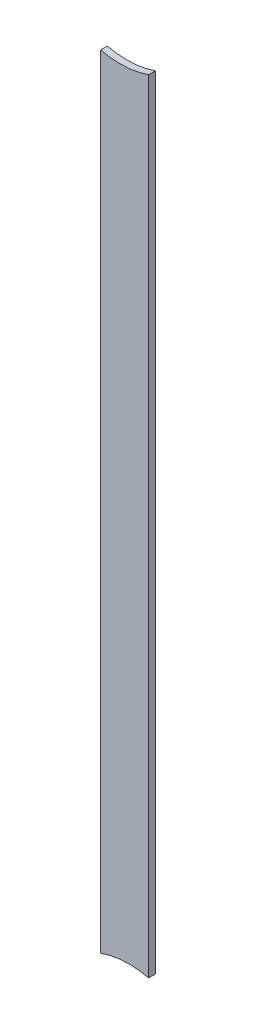
ISO-10303-21;
HEADER;
FILE_DESCRIPTION(('STEP AP214'),'2;1');
FILE_NAME('part.step','',(''),(''),'','','');
FILE_SCHEMA(('AUTOMOTIVE_DESIGN { 1 0 10303 214 1 1 1 1 }'));
ENDSEC;
DATA;
#1=APPLICATION_CONTEXT('core data for automotive mechanical design processes');
#2=APPLICATION_PROTOCOL_DEFINITION('international standard','automotive_design',2000,#1);
#3=PRODUCT_CONTEXT('',#1,'mechanical');
#4=PRODUCT('Part','Part','',(#3));
#5=PRODUCT_RELATED_PRODUCT_CATEGORY('part','',(#4));
#6=PRODUCT_DEFINITION_FORMATION('','',#4);
#7=PRODUCT_DEFINITION_CONTEXT('part definition',#1,'design');
#8=PRODUCT_DEFINITION('design','',#6,#7);
#9=PRODUCT_DEFINITION_SHAPE('','',#8);
#10=(LENGTH_UNIT() NAMED_UNIT(*) SI_UNIT(.MILLI.,.METRE.));
#11=(NAMED_UNIT(*) PLANE_ANGLE_UNIT() SI_UNIT($,.RADIAN.));
#12=(NAMED_UNIT(*) SI_UNIT($,.STERADIAN.) SOLID_ANGLE_UNIT());
#13=UNCERTAINTY_MEASURE_WITH_UNIT(LENGTH_MEASURE(1.E-05),#10,'distance_accuracy_value','');
#14=(GEOMETRIC_REPRESENTATION_CONTEXT(3) GLOBAL_UNCERTAINTY_ASSIGNED_CONTEXT((#13)) GLOBAL_UNIT_ASSIGNED_CONTEXT((#10,
#11,#12)) REPRESENTATION_CONTEXT('',''));
#15=CARTESIAN_POINT('',(0.,0.,0.));
#16=DIRECTION('',(0.,0.,1.));
#17=DIRECTION('',(1.,0.,0.));
#18=AXIS2_PLACEMENT_3D('',#15,#16,#17);
#19=CARTESIAN_POINT('',(89.0409954,88.0247857001998,0.));
#20=DIRECTION('',(-1.,0.,0.));
#21=DIRECTION('',(0.,1.,0.));
#22=AXIS2_PLACEMENT_3D('',#19,#20,#21);
#23=PLANE('',#22);
#24=DIRECTION('',(0.,1.,0.));
#25=VECTOR('',#24,1.);
#26=CARTESIAN_POINT('',(89.0409954,87.6099594,0.03556));
#27=LINE('',#26,#25);
#28=CARTESIAN_POINT('',(89.0409954,88.0247857001998,0.03556));
#29=VERTEX_POINT('',#28);
#30=CARTESIAN_POINT('',(89.0409954,92.149740689902,0.03556));
#31=VERTEX_POINT('',#30);
#32=EDGE_CURVE('E11',#29,#31,#27,.T.);
#33=ORIENTED_EDGE('',*,*,#32,.F.);
#34=DIRECTION('',(0.,0.,1.));
#35=VECTOR('',#34,1.);
#36=CARTESIAN_POINT('',(89.0409954,88.0247857001998,0.));
#37=LINE('',#36,#35);
#38=CARTESIAN_POINT('',(89.0409954,88.0247857001998,0.));
#39=VERTEX_POINT('',#38);
#40=EDGE_CURVE('E24',#39,#29,#37,.T.);
#41=ORIENTED_EDGE('',*,*,#40,.F.);
#42=DIRECTION('',(0.,1.,0.));
#43=VECTOR('',#42,1.);
#44=CARTESIAN_POINT('',(89.0409954,87.6099594,0.));
#45=LINE('',#44,#43);
#46=CARTESIAN_POINT('',(89.0409954,92.149740689902,0.));
#47=VERTEX_POINT('',#46);
#48=EDGE_CURVE('E75',#39,#47,#45,.T.);
#49=ORIENTED_EDGE('',*,*,#48,.T.);
#50=DIRECTION('',(0.,0.,1.));
#51=VECTOR('',#50,1.);
#52=CARTESIAN_POINT('',(89.0409954,92.149740689902,0.));
#53=LINE('',#52,#51);
#54=EDGE_CURVE('E37',#47,#31,#53,.T.);
#55=ORIENTED_EDGE('',*,*,#54,.T.);
#56=EDGE_LOOP('',(#33,#41,#49,#55));
#57=FACE_BOUND('',#56,.T.);
#58=ADVANCED_FACE('F17',(#57),#23,.F.);
#59=CARTESIAN_POINT('',(88.8910084,92.5740084,0.));
#60=DIRECTION('',(0.,0.,-1.));
#61=DIRECTION('',(1.,0.,0.));
#62=AXIS2_PLACEMENT_3D('',#59,#60,#61);
#63=CYLINDRICAL_SURFACE('',#62,0.4499991);
#64=DIRECTION('',(0.,0.,1.));
#65=VECTOR('',#64,1.);
#66=CARTESIAN_POINT('',(88.7869954,92.1361950998002,0.));
#67=LINE('',#66,#65);
#68=CARTESIAN_POINT('',(88.7869954,92.1361950998002,0.));
#69=VERTEX_POINT('',#68);
#70=CARTESIAN_POINT('',(88.7869954,92.1361950998002,0.03556));
#71=VERTEX_POINT('',#70);
#72=EDGE_CURVE('E67',#69,#71,#67,.T.);
#73=ORIENTED_EDGE('',*,*,#72,.T.);
#74=CARTESIAN_POINT('',(88.8910084,92.5740084,0.03556));
#75=DIRECTION('',(0.,0.,1.));
#76=DIRECTION('',(1.,0.,0.));
#77=AXIS2_PLACEMENT_3D('',#74,#75,#76);
#78=CIRCLE('',#77,0.4499991);
#79=EDGE_CURVE('E82',#71,#31,#78,.T.);
#80=ORIENTED_EDGE('',*,*,#79,.T.);
#81=ORIENTED_EDGE('',*,*,#54,.F.);
#82=CARTESIAN_POINT('',(88.8910084,92.5740084,0.));
#83=DIRECTION('',(0.,0.,1.));
#84=DIRECTION('',(1.,0.,0.));
#85=AXIS2_PLACEMENT_3D('',#82,#83,#84);
#86=CIRCLE('',#85,0.4499991);
#87=EDGE_CURVE('E80',#69,#47,#86,.T.);
#88=ORIENTED_EDGE('',*,*,#87,.F.);
#89=EDGE_LOOP('',(#73,#80,#81,#88));
#90=FACE_BOUND('',#89,.T.);
#91=ADVANCED_FACE('F88',(#90),#63,.F.);
#92=CARTESIAN_POINT('',(88.7869954,92.1361950998002,0.));
#93=DIRECTION('',(1.,0.,0.));
#94=DIRECTION('',(0.,-1.,0.));
#95=AXIS2_PLACEMENT_3D('',#92,#93,#94);
#96=PLANE('',#95);
#97=DIRECTION('',(0.,-1.,0.));
#98=VECTOR('',#97,1.);
#99=CARTESIAN_POINT('',(88.7869954,92.5510214,0.03556));
#100=LINE('',#99,#98);
#101=CARTESIAN_POINT('',(88.7869954,88.011240110098,0.03556));
#102=VERTEX_POINT('',#101);
#103=EDGE_CURVE('E71',#71,#102,#100,.T.);
#104=ORIENTED_EDGE('',*,*,#103,.F.);
#105=ORIENTED_EDGE('',*,*,#72,.F.);
#106=DIRECTION('',(0.,-1.,0.));
#107=VECTOR('',#106,1.);
#108=CARTESIAN_POINT('',(88.7869954,92.5510214,0.));
#109=LINE('',#108,#107);
#110=CARTESIAN_POINT('',(88.7869954,88.011240110098,0.));
#111=VERTEX_POINT('',#110);
#112=EDGE_CURVE('E63',#69,#111,#109,.T.);
#113=ORIENTED_EDGE('',*,*,#112,.T.);
#114=DIRECTION('',(0.,0.,1.));
#115=VECTOR('',#114,1.);
#116=CARTESIAN_POINT('',(88.7869954,88.011240110098,0.));
#117=LINE('',#116,#115);
#118=EDGE_CURVE('E53',#111,#102,#117,.T.);
#119=ORIENTED_EDGE('',*,*,#118,.T.);
#120=EDGE_LOOP('',(#104,#105,#113,#119));
#121=FACE_BOUND('',#120,.T.);
#122=ADVANCED_FACE('F66',(#121),#96,.F.);
#123=CARTESIAN_POINT('',(88.9369824,87.5869724,0.));
#124=DIRECTION('',(0.,0.,-1.));
#125=DIRECTION('',(1.,0.,0.));
#126=AXIS2_PLACEMENT_3D('',#123,#124,#125);
#127=CYLINDRICAL_SURFACE('',#126,0.4499991);
#128=ORIENTED_EDGE('',*,*,#40,.T.);
#129=CARTESIAN_POINT('',(88.9369824,87.5869724,0.03556));
#130=DIRECTION('',(0.,0.,1.));
#131=DIRECTION('',(1.,0.,0.));
#132=AXIS2_PLACEMENT_3D('',#129,#130,#131);
#133=CIRCLE('',#132,0.4499991);
#134=EDGE_CURVE('E59',#29,#102,#133,.T.);
#135=ORIENTED_EDGE('',*,*,#134,.T.);
#136=ORIENTED_EDGE('',*,*,#118,.F.);
#137=CARTESIAN_POINT('',(88.9369824,87.5869724,0.));
#138=DIRECTION('',(0.,0.,1.));
#139=DIRECTION('',(1.,0.,0.));
#140=AXIS2_PLACEMENT_3D('',#137,#138,#139);
#141=CIRCLE('',#140,0.4499991);
#142=EDGE_CURVE('E57',#39,#111,#141,.T.);
#143=ORIENTED_EDGE('',*,*,#142,.F.);
#144=EDGE_LOOP('',(#128,#135,#136,#143));
#145=FACE_BOUND('',#144,.T.);
#146=ADVANCED_FACE('F55',(#145),#127,.F.);
#147=CARTESIAN_POINT('',(89.0409954,87.6099594,0.));
#148=DIRECTION('',(0.,0.,-1.));
#149=DIRECTION('',(-1.,0.,0.));
#150=AXIS2_PLACEMENT_3D('',#147,#148,#149);
#151=PLANE('',#150);
#152=ORIENTED_EDGE('',*,*,#48,.F.);
#153=ORIENTED_EDGE('',*,*,#142,.T.);
#154=ORIENTED_EDGE('',*,*,#112,.F.);
#155=ORIENTED_EDGE('',*,*,#87,.T.);
#156=EDGE_LOOP('',(#152,#153,#154,#155));
#157=FACE_BOUND('',#156,.T.);
#158=ADVANCED_FACE('F74',(#157),#151,.T.);
#159=CARTESIAN_POINT('',(89.0409954,87.6099594,0.03556));
#160=DIRECTION('',(0.,0.,-1.));
#161=DIRECTION('',(-1.,0.,0.));
#162=AXIS2_PLACEMENT_3D('',#159,#160,#161);
#163=PLANE('',#162);
#164=ORIENTED_EDGE('',*,*,#134,.F.);
#165=ORIENTED_EDGE('',*,*,#32,.T.);
#166=ORIENTED_EDGE('',*,*,#79,.F.);
#167=ORIENTED_EDGE('',*,*,#103,.T.);
#168=EDGE_LOOP('',(#164,#165,#166,#167));
#169=FACE_BOUND('',#168,.T.);
#170=ADVANCED_FACE('F91',(#169),#163,.F.);
#171=CLOSED_SHELL('',(#58,#91,#122,#146,#158,#170));
#172=MANIFOLD_SOLID_BREP('B1',#171);
#173=ADVANCED_BREP_SHAPE_REPRESENTATION('',(#18,#172),#14);
#174=SHAPE_DEFINITION_REPRESENTATION(#9,#173);
ENDSEC;
END-ISO-10303-21;
